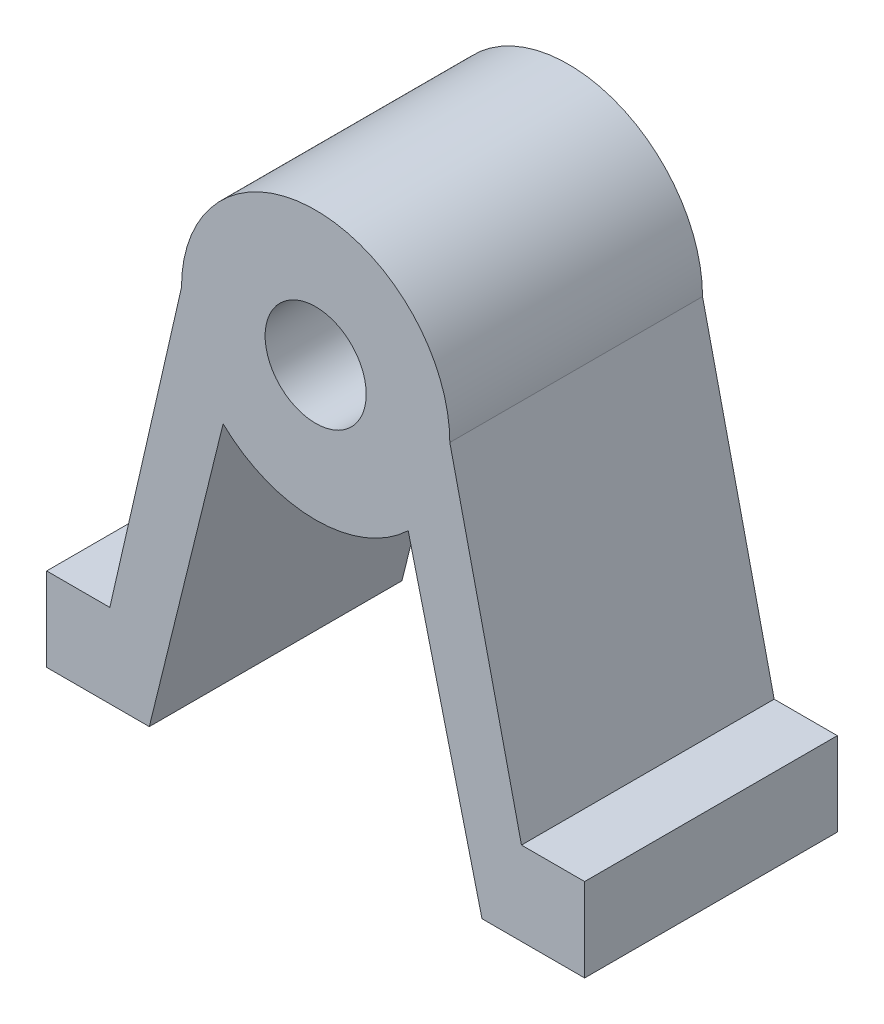
ISO-10303-21;
HEADER;
FILE_DESCRIPTION(('STEP AP214'),'2;1');
FILE_NAME('part.step','',(''),(''),'','','');
FILE_SCHEMA(('AUTOMOTIVE_DESIGN { 1 0 10303 214 1 1 1 1 }'));
ENDSEC;
DATA;
#1=APPLICATION_CONTEXT('core data for automotive mechanical design processes');
#2=APPLICATION_PROTOCOL_DEFINITION('international standard','automotive_design',2000,#1);
#3=PRODUCT_CONTEXT('',#1,'mechanical');
#4=PRODUCT('Part','Part','',(#3));
#5=PRODUCT_RELATED_PRODUCT_CATEGORY('part','',(#4));
#6=PRODUCT_DEFINITION_FORMATION('','',#4);
#7=PRODUCT_DEFINITION_CONTEXT('part definition',#1,'design');
#8=PRODUCT_DEFINITION('design','',#6,#7);
#9=PRODUCT_DEFINITION_SHAPE('','',#8);
#10=(LENGTH_UNIT() NAMED_UNIT(*) SI_UNIT(.MILLI.,.METRE.));
#11=(NAMED_UNIT(*) PLANE_ANGLE_UNIT() SI_UNIT($,.RADIAN.));
#12=(NAMED_UNIT(*) SI_UNIT($,.STERADIAN.) SOLID_ANGLE_UNIT());
#13=UNCERTAINTY_MEASURE_WITH_UNIT(LENGTH_MEASURE(1.E-05),#10,'distance_accuracy_value','');
#14=(GEOMETRIC_REPRESENTATION_CONTEXT(3) GLOBAL_UNCERTAINTY_ASSIGNED_CONTEXT((#13)) GLOBAL_UNIT_ASSIGNED_CONTEXT((#10,
#11,#12)) REPRESENTATION_CONTEXT('',''));
#15=CARTESIAN_POINT('',(0.,0.,0.));
#16=DIRECTION('',(0.,0.,1.));
#17=DIRECTION('',(1.,0.,0.));
#18=AXIS2_PLACEMENT_3D('',#15,#16,#17);
#19=CARTESIAN_POINT('',(-48.3392895586652,36.6997165410836,20.));
#20=DIRECTION('',(0.,0.,1.));
#21=DIRECTION('',(1.,0.,0.));
#22=AXIS2_PLACEMENT_3D('',#19,#20,#21);
#23=PLANE('',#22);
#24=CARTESIAN_POINT('',(-48.3392895586652,36.6997165410836,20.));
#25=DIRECTION('',(0.,0.,1.));
#26=DIRECTION('',(1.,0.,0.));
#27=AXIS2_PLACEMENT_3D('',#24,#25,#26);
#28=CIRCLE('',#27,10.62);
#29=CARTESIAN_POINT('',(-37.7192895586652,36.6997165410836,20.));
#30=VERTEX_POINT('',#29);
#31=CARTESIAN_POINT('',(-58.9592895586652,36.6997165410836,20.));
#32=VERTEX_POINT('',#31);
#33=EDGE_CURVE('E179',#30,#32,#28,.T.);
#34=ORIENTED_EDGE('',*,*,#33,.T.);
#35=DIRECTION('',(-0.223216238641194,-0.974768952525098,0.));
#36=VECTOR('',#35,1.);
#37=CARTESIAN_POINT('',(-58.9592895586652,36.6997165410836,20.));
#38=LINE('',#37,#36);
#39=CARTESIAN_POINT('',(-64.6288762631638,11.9410469799597,20.));
#40=VERTEX_POINT('',#39);
#41=EDGE_CURVE('E107',#32,#40,#38,.T.);
#42=ORIENTED_EDGE('',*,*,#41,.T.);
#43=DIRECTION('',(-1.,0.,0.));
#44=VECTOR('',#43,1.);
#45=CARTESIAN_POINT('',(-64.6288762631638,11.9410469799597,20.));
#46=LINE('',#45,#44);
#47=CARTESIAN_POINT('',(-69.6288762631638,11.9410469799597,20.));
#48=VERTEX_POINT('',#47);
#49=EDGE_CURVE('E206',#40,#48,#46,.T.);
#50=ORIENTED_EDGE('',*,*,#49,.T.);
#51=DIRECTION('',(0.,-1.,0.));
#52=VECTOR('',#51,1.);
#53=CARTESIAN_POINT('',(-69.6288762631638,11.9410469799597,20.));
#54=LINE('',#53,#52);
#55=CARTESIAN_POINT('',(-69.6288762631638,5.3297165410836,20.));
#56=VERTEX_POINT('',#55);
#57=EDGE_CURVE('E225',#48,#56,#54,.T.);
#58=ORIENTED_EDGE('',*,*,#57,.T.);
#59=DIRECTION('',(1.,0.,0.));
#60=VECTOR('',#59,1.);
#61=CARTESIAN_POINT('',(-69.6288762631638,5.3297165410836,20.));
#62=LINE('',#61,#60);
#63=CARTESIAN_POINT('',(-61.5049473980364,5.32971654108361,20.));
#64=VERTEX_POINT('',#63);
#65=EDGE_CURVE('E222',#56,#64,#62,.T.);
#66=ORIENTED_EDGE('',*,*,#65,.T.);
#67=DIRECTION('',(0.239510428212792,0.970893791708097,0.));
#68=VECTOR('',#67,1.);
#69=CARTESIAN_POINT('',(-55.6634033552751,29.0093487284034,20.));
#70=LINE('',#69,#68);
#71=CARTESIAN_POINT('',(-55.6634033552751,29.0093487284034,20.));
#72=VERTEX_POINT('',#71);
#73=EDGE_CURVE('E224',#64,#72,#70,.T.);
#74=ORIENTED_EDGE('',*,*,#73,.T.);
#75=CARTESIAN_POINT('',(-48.3392895586652,36.6997165410836,20.));
#76=DIRECTION('',(0.,0.,1.));
#77=DIRECTION('',(1.,0.,0.));
#78=AXIS2_PLACEMENT_3D('',#75,#76,#77);
#79=CIRCLE('',#78,10.62);
#80=CARTESIAN_POINT('',(-41.0151757620553,29.0093487284034,20.));
#81=VERTEX_POINT('',#80);
#82=EDGE_CURVE('E227',#72,#81,#79,.T.);
#83=ORIENTED_EDGE('',*,*,#82,.T.);
#84=DIRECTION('',(0.239510428212792,-0.970893791708097,0.));
#85=VECTOR('',#84,1.);
#86=CARTESIAN_POINT('',(-41.0151757620553,29.0093487284034,20.));
#87=LINE('',#86,#85);
#88=CARTESIAN_POINT('',(-35.173631719294,5.32971654108361,20.));
#89=VERTEX_POINT('',#88);
#90=EDGE_CURVE('E233',#81,#89,#87,.T.);
#91=ORIENTED_EDGE('',*,*,#90,.T.);
#92=DIRECTION('',(1.,0.,0.));
#93=VECTOR('',#92,1.);
#94=CARTESIAN_POINT('',(-27.0497028541666,5.3297165410836,20.));
#95=LINE('',#94,#93);
#96=CARTESIAN_POINT('',(-27.0497028541666,5.3297165410836,20.));
#97=VERTEX_POINT('',#96);
#98=EDGE_CURVE('E138',#89,#97,#95,.T.);
#99=ORIENTED_EDGE('',*,*,#98,.T.);
#100=DIRECTION('',(0.,1.,0.));
#101=VECTOR('',#100,1.);
#102=CARTESIAN_POINT('',(-27.0497028541666,11.9410469799597,20.));
#103=LINE('',#102,#101);
#104=CARTESIAN_POINT('',(-27.0497028541666,11.9410469799597,20.));
#105=VERTEX_POINT('',#104);
#106=EDGE_CURVE('E132',#97,#105,#103,.T.);
#107=ORIENTED_EDGE('',*,*,#106,.T.);
#108=DIRECTION('',(-1.,0.,0.));
#109=VECTOR('',#108,1.);
#110=CARTESIAN_POINT('',(-32.0497028541666,11.9410469799597,20.));
#111=LINE('',#110,#109);
#112=CARTESIAN_POINT('',(-32.0497028541666,11.9410469799597,20.));
#113=VERTEX_POINT('',#112);
#114=EDGE_CURVE('E136',#105,#113,#111,.T.);
#115=ORIENTED_EDGE('',*,*,#114,.T.);
#116=DIRECTION('',(-0.223216238641194,0.974768952525098,0.));
#117=VECTOR('',#116,1.);
#118=CARTESIAN_POINT('',(-37.7192895586652,36.6997165410836,20.));
#119=LINE('',#118,#117);
#120=EDGE_CURVE('E52',#113,#30,#119,.T.);
#121=ORIENTED_EDGE('',*,*,#120,.T.);
#122=EDGE_LOOP('',(#34,#42,#50,#58,#66,#74,#83,#91,#99,#107,#115,#121));
#123=FACE_BOUND('',#122,.T.);
#124=CARTESIAN_POINT('',(-48.3392895586652,36.6997165410836,20.));
#125=DIRECTION('',(0.,0.,1.));
#126=DIRECTION('',(1.,0.,0.));
#127=AXIS2_PLACEMENT_3D('',#124,#125,#126);
#128=CIRCLE('',#127,4.);
#129=CARTESIAN_POINT('',(-44.3392895586652,36.6997165410836,20.));
#130=VERTEX_POINT('',#129);
#131=EDGE_CURVE('E160',#130,#130,#128,.T.);
#132=ORIENTED_EDGE('',*,*,#131,.F.);
#133=EDGE_LOOP('',(#132));
#134=FACE_BOUND('',#133,.T.);
#135=ADVANCED_FACE('F35',(#123,#134),#23,.T.);
#136=CARTESIAN_POINT('',(-48.3392895586652,36.6997165410836,0.));
#137=DIRECTION('',(0.,0.,1.));
#138=DIRECTION('',(1.,0.,0.));
#139=AXIS2_PLACEMENT_3D('',#136,#137,#138);
#140=PLANE('',#139);
#141=CARTESIAN_POINT('',(-48.3392895586652,36.6997165410836,0.));
#142=DIRECTION('',(0.,0.,1.));
#143=DIRECTION('',(1.,0.,0.));
#144=AXIS2_PLACEMENT_3D('',#141,#142,#143);
#145=CIRCLE('',#144,10.62);
#146=CARTESIAN_POINT('',(-37.7192895586652,36.6997165410836,0.));
#147=VERTEX_POINT('',#146);
#148=CARTESIAN_POINT('',(-58.9592895586652,36.6997165410836,0.));
#149=VERTEX_POINT('',#148);
#150=EDGE_CURVE('E156',#147,#149,#145,.T.);
#151=ORIENTED_EDGE('',*,*,#150,.F.);
#152=DIRECTION('',(-0.223216238641194,0.974768952525098,0.));
#153=VECTOR('',#152,1.);
#154=CARTESIAN_POINT('',(-37.7192895586652,36.6997165410836,0.));
#155=LINE('',#154,#153);
#156=CARTESIAN_POINT('',(-32.0497028541666,11.9410469799597,0.));
#157=VERTEX_POINT('',#156);
#158=EDGE_CURVE('E99',#157,#147,#155,.T.);
#159=ORIENTED_EDGE('',*,*,#158,.F.);
#160=DIRECTION('',(-1.,0.,0.));
#161=VECTOR('',#160,1.);
#162=CARTESIAN_POINT('',(-32.0497028541666,11.9410469799597,0.));
#163=LINE('',#162,#161);
#164=CARTESIAN_POINT('',(-27.0497028541666,11.9410469799597,0.));
#165=VERTEX_POINT('',#164);
#166=EDGE_CURVE('E93',#165,#157,#163,.T.);
#167=ORIENTED_EDGE('',*,*,#166,.F.);
#168=DIRECTION('',(0.,1.,0.));
#169=VECTOR('',#168,1.);
#170=CARTESIAN_POINT('',(-27.0497028541666,11.9410469799597,0.));
#171=LINE('',#170,#169);
#172=CARTESIAN_POINT('',(-27.0497028541666,5.3297165410836,0.));
#173=VERTEX_POINT('',#172);
#174=EDGE_CURVE('E146',#173,#165,#171,.T.);
#175=ORIENTED_EDGE('',*,*,#174,.F.);
#176=DIRECTION('',(1.,0.,0.));
#177=VECTOR('',#176,1.);
#178=CARTESIAN_POINT('',(-27.0497028541666,5.3297165410836,0.));
#179=LINE('',#178,#177);
#180=CARTESIAN_POINT('',(-35.173631719294,5.32971654108361,0.));
#181=VERTEX_POINT('',#180);
#182=EDGE_CURVE('E174',#181,#173,#179,.T.);
#183=ORIENTED_EDGE('',*,*,#182,.F.);
#184=DIRECTION('',(0.239510428212792,-0.970893791708097,0.));
#185=VECTOR('',#184,1.);
#186=CARTESIAN_POINT('',(-41.0151757620553,29.0093487284034,0.));
#187=LINE('',#186,#185);
#188=CARTESIAN_POINT('',(-41.0151757620553,29.0093487284034,0.));
#189=VERTEX_POINT('',#188);
#190=EDGE_CURVE('E172',#189,#181,#187,.T.);
#191=ORIENTED_EDGE('',*,*,#190,.F.);
#192=CARTESIAN_POINT('',(-48.3392895586652,36.6997165410836,0.));
#193=DIRECTION('',(0.,0.,1.));
#194=DIRECTION('',(1.,0.,0.));
#195=AXIS2_PLACEMENT_3D('',#192,#193,#194);
#196=CIRCLE('',#195,10.62);
#197=CARTESIAN_POINT('',(-55.6634033552751,29.0093487284034,0.));
#198=VERTEX_POINT('',#197);
#199=EDGE_CURVE('E170',#198,#189,#196,.T.);
#200=ORIENTED_EDGE('',*,*,#199,.F.);
#201=DIRECTION('',(0.239510428212792,0.970893791708097,0.));
#202=VECTOR('',#201,1.);
#203=CARTESIAN_POINT('',(-55.6634033552751,29.0093487284034,0.));
#204=LINE('',#203,#202);
#205=CARTESIAN_POINT('',(-61.5049473980364,5.32971654108361,0.));
#206=VERTEX_POINT('',#205);
#207=EDGE_CURVE('E168',#206,#198,#204,.T.);
#208=ORIENTED_EDGE('',*,*,#207,.F.);
#209=DIRECTION('',(1.,0.,0.));
#210=VECTOR('',#209,1.);
#211=CARTESIAN_POINT('',(-69.6288762631638,5.3297165410836,0.));
#212=LINE('',#211,#210);
#213=CARTESIAN_POINT('',(-69.6288762631638,5.3297165410836,0.));
#214=VERTEX_POINT('',#213);
#215=EDGE_CURVE('E166',#214,#206,#212,.T.);
#216=ORIENTED_EDGE('',*,*,#215,.F.);
#217=DIRECTION('',(0.,-1.,0.));
#218=VECTOR('',#217,1.);
#219=CARTESIAN_POINT('',(-69.6288762631638,11.9410469799597,0.));
#220=LINE('',#219,#218);
#221=CARTESIAN_POINT('',(-69.6288762631638,11.9410469799597,0.));
#222=VERTEX_POINT('',#221);
#223=EDGE_CURVE('E164',#222,#214,#220,.T.);
#224=ORIENTED_EDGE('',*,*,#223,.F.);
#225=DIRECTION('',(-1.,0.,0.));
#226=VECTOR('',#225,1.);
#227=CARTESIAN_POINT('',(-64.6288762631638,11.9410469799597,0.));
#228=LINE('',#227,#226);
#229=CARTESIAN_POINT('',(-64.6288762631638,11.9410469799597,0.));
#230=VERTEX_POINT('',#229);
#231=EDGE_CURVE('E162',#230,#222,#228,.T.);
#232=ORIENTED_EDGE('',*,*,#231,.F.);
#233=DIRECTION('',(-0.223216238641194,-0.974768952525098,0.));
#234=VECTOR('',#233,1.);
#235=CARTESIAN_POINT('',(-58.9592895586652,36.6997165410836,0.));
#236=LINE('',#235,#234);
#237=EDGE_CURVE('E159',#149,#230,#236,.T.);
#238=ORIENTED_EDGE('',*,*,#237,.F.);
#239=EDGE_LOOP('',(#151,#159,#167,#175,#183,#191,#200,#208,#216,#224,#232,#238));
#240=FACE_BOUND('',#239,.T.);
#241=CARTESIAN_POINT('',(-48.3392895586652,36.6997165410836,0.));
#242=DIRECTION('',(0.,0.,1.));
#243=DIRECTION('',(1.,0.,0.));
#244=AXIS2_PLACEMENT_3D('',#241,#242,#243);
#245=CIRCLE('',#244,4.);
#246=CARTESIAN_POINT('',(-44.3392895586652,36.6997165410836,0.));
#247=VERTEX_POINT('',#246);
#248=EDGE_CURVE('E380',#247,#247,#245,.T.);
#249=ORIENTED_EDGE('',*,*,#248,.T.);
#250=EDGE_LOOP('',(#249));
#251=FACE_BOUND('',#250,.T.);
#252=ADVANCED_FACE('F210',(#240,#251),#140,.F.);
#253=CARTESIAN_POINT('',(-48.3392895586652,36.6997165410836,20.));
#254=DIRECTION('',(0.,0.,-1.));
#255=DIRECTION('',(-1.,0.,0.));
#256=AXIS2_PLACEMENT_3D('',#253,#254,#255);
#257=CYLINDRICAL_SURFACE('',#256,10.62);
#258=ORIENTED_EDGE('',*,*,#150,.T.);
#259=DIRECTION('',(0.,0.,-1.));
#260=VECTOR('',#259,1.);
#261=CARTESIAN_POINT('',(-58.9592895586652,36.6997165410836,20.));
#262=LINE('',#261,#260);
#263=EDGE_CURVE('E11',#32,#149,#262,.T.);
#264=ORIENTED_EDGE('',*,*,#263,.F.);
#265=ORIENTED_EDGE('',*,*,#33,.F.);
#266=DIRECTION('',(0.,0.,-1.));
#267=VECTOR('',#266,1.);
#268=CARTESIAN_POINT('',(-37.7192895586652,36.6997165410836,20.));
#269=LINE('',#268,#267);
#270=EDGE_CURVE('E152',#30,#147,#269,.T.);
#271=ORIENTED_EDGE('',*,*,#270,.T.);
#272=EDGE_LOOP('',(#258,#264,#265,#271));
#273=FACE_BOUND('',#272,.T.);
#274=ADVANCED_FACE('F37',(#273),#257,.T.);
#275=CARTESIAN_POINT('',(-58.9592895586652,36.6997165410836,20.));
#276=DIRECTION('',(0.974768952525098,-0.223216238641194,0.));
#277=DIRECTION('',(0.223216238641194,0.974768952525099,0.));
#278=AXIS2_PLACEMENT_3D('',#275,#276,#277);
#279=PLANE('',#278);
#280=ORIENTED_EDGE('',*,*,#237,.T.);
#281=DIRECTION('',(0.,0.,-1.));
#282=VECTOR('',#281,1.);
#283=CARTESIAN_POINT('',(-64.6288762631638,11.9410469799597,20.));
#284=LINE('',#283,#282);
#285=EDGE_CURVE('E44',#40,#230,#284,.T.);
#286=ORIENTED_EDGE('',*,*,#285,.F.);
#287=ORIENTED_EDGE('',*,*,#41,.F.);
#288=ORIENTED_EDGE('',*,*,#263,.T.);
#289=EDGE_LOOP('',(#280,#286,#287,#288));
#290=FACE_BOUND('',#289,.T.);
#291=ADVANCED_FACE('F267',(#290),#279,.F.);
#292=CARTESIAN_POINT('',(-64.6288762631638,11.9410469799597,20.));
#293=DIRECTION('',(0.,-1.,0.));
#294=DIRECTION('',(0.,0.,-1.));
#295=AXIS2_PLACEMENT_3D('',#292,#293,#294);
#296=PLANE('',#295);
#297=ORIENTED_EDGE('',*,*,#231,.T.);
#298=DIRECTION('',(0.,0.,-1.));
#299=VECTOR('',#298,1.);
#300=CARTESIAN_POINT('',(-69.6288762631638,11.9410469799597,20.));
#301=LINE('',#300,#299);
#302=EDGE_CURVE('E198',#48,#222,#301,.T.);
#303=ORIENTED_EDGE('',*,*,#302,.F.);
#304=ORIENTED_EDGE('',*,*,#49,.F.);
#305=ORIENTED_EDGE('',*,*,#285,.T.);
#306=EDGE_LOOP('',(#297,#303,#304,#305));
#307=FACE_BOUND('',#306,.T.);
#308=ADVANCED_FACE('F204',(#307),#296,.F.);
#309=CARTESIAN_POINT('',(-69.6288762631638,11.9410469799597,20.));
#310=DIRECTION('',(1.,0.,0.));
#311=DIRECTION('',(0.,0.,-1.));
#312=AXIS2_PLACEMENT_3D('',#309,#310,#311);
#313=PLANE('',#312);
#314=ORIENTED_EDGE('',*,*,#223,.T.);
#315=DIRECTION('',(0.,0.,-1.));
#316=VECTOR('',#315,1.);
#317=CARTESIAN_POINT('',(-69.6288762631638,5.3297165410836,20.));
#318=LINE('',#317,#316);
#319=EDGE_CURVE('E195',#56,#214,#318,.T.);
#320=ORIENTED_EDGE('',*,*,#319,.F.);
#321=ORIENTED_EDGE('',*,*,#57,.F.);
#322=ORIENTED_EDGE('',*,*,#302,.T.);
#323=EDGE_LOOP('',(#314,#320,#321,#322));
#324=FACE_BOUND('',#323,.T.);
#325=ADVANCED_FACE('F216',(#324),#313,.F.);
#326=CARTESIAN_POINT('',(-69.6288762631638,5.3297165410836,20.));
#327=DIRECTION('',(0.,1.,0.));
#328=DIRECTION('',(-1.,0.,0.));
#329=AXIS2_PLACEMENT_3D('',#326,#327,#328);
#330=PLANE('',#329);
#331=ORIENTED_EDGE('',*,*,#215,.T.);
#332=DIRECTION('',(0.,0.,-1.));
#333=VECTOR('',#332,1.);
#334=CARTESIAN_POINT('',(-61.5049473980364,5.32971654108361,20.));
#335=LINE('',#334,#333);
#336=EDGE_CURVE('E192',#64,#206,#335,.T.);
#337=ORIENTED_EDGE('',*,*,#336,.F.);
#338=ORIENTED_EDGE('',*,*,#65,.F.);
#339=ORIENTED_EDGE('',*,*,#319,.T.);
#340=EDGE_LOOP('',(#331,#337,#338,#339));
#341=FACE_BOUND('',#340,.T.);
#342=ADVANCED_FACE('F220',(#341),#330,.F.);
#343=CARTESIAN_POINT('',(-55.6634033552751,29.0093487284034,20.));
#344=DIRECTION('',(-0.970893791708097,0.239510428212792,0.));
#345=DIRECTION('',(-0.239510428212792,-0.970893791708097,0.));
#346=AXIS2_PLACEMENT_3D('',#343,#344,#345);
#347=PLANE('',#346);
#348=ORIENTED_EDGE('',*,*,#207,.T.);
#349=DIRECTION('',(0.,0.,-1.));
#350=VECTOR('',#349,1.);
#351=CARTESIAN_POINT('',(-55.6634033552751,29.0093487284034,20.));
#352=LINE('',#351,#350);
#353=EDGE_CURVE('E189',#72,#198,#352,.T.);
#354=ORIENTED_EDGE('',*,*,#353,.F.);
#355=ORIENTED_EDGE('',*,*,#73,.F.);
#356=ORIENTED_EDGE('',*,*,#336,.T.);
#357=EDGE_LOOP('',(#348,#354,#355,#356));
#358=FACE_BOUND('',#357,.T.);
#359=ADVANCED_FACE('F280',(#358),#347,.F.);
#360=CARTESIAN_POINT('',(-48.3392895586652,36.6997165410836,20.));
#361=DIRECTION('',(0.,0.,-1.));
#362=DIRECTION('',(-1.,0.,0.));
#363=AXIS2_PLACEMENT_3D('',#360,#361,#362);
#364=CYLINDRICAL_SURFACE('',#363,10.62);
#365=ORIENTED_EDGE('',*,*,#199,.T.);
#366=DIRECTION('',(0.,0.,-1.));
#367=VECTOR('',#366,1.);
#368=CARTESIAN_POINT('',(-41.0151757620553,29.0093487284034,20.));
#369=LINE('',#368,#367);
#370=EDGE_CURVE('E186',#81,#189,#369,.T.);
#371=ORIENTED_EDGE('',*,*,#370,.F.);
#372=ORIENTED_EDGE('',*,*,#82,.F.);
#373=ORIENTED_EDGE('',*,*,#353,.T.);
#374=EDGE_LOOP('',(#365,#371,#372,#373));
#375=FACE_BOUND('',#374,.T.);
#376=ADVANCED_FACE('F283',(#375),#364,.T.);
#377=CARTESIAN_POINT('',(-41.0151757620553,29.0093487284034,20.));
#378=DIRECTION('',(0.970893791708097,0.239510428212792,0.));
#379=DIRECTION('',(-0.239510428212792,0.970893791708097,0.));
#380=AXIS2_PLACEMENT_3D('',#377,#378,#379);
#381=PLANE('',#380);
#382=ORIENTED_EDGE('',*,*,#190,.T.);
#383=DIRECTION('',(0.,0.,-1.));
#384=VECTOR('',#383,1.);
#385=CARTESIAN_POINT('',(-35.173631719294,5.32971654108361,20.));
#386=LINE('',#385,#384);
#387=EDGE_CURVE('E183',#89,#181,#386,.T.);
#388=ORIENTED_EDGE('',*,*,#387,.F.);
#389=ORIENTED_EDGE('',*,*,#90,.F.);
#390=ORIENTED_EDGE('',*,*,#370,.T.);
#391=EDGE_LOOP('',(#382,#388,#389,#390));
#392=FACE_BOUND('',#391,.T.);
#393=ADVANCED_FACE('F239',(#392),#381,.F.);
#394=CARTESIAN_POINT('',(-27.0497028541666,5.3297165410836,20.));
#395=DIRECTION('',(0.,1.,0.));
#396=DIRECTION('',(-1.,0.,0.));
#397=AXIS2_PLACEMENT_3D('',#394,#395,#396);
#398=PLANE('',#397);
#399=ORIENTED_EDGE('',*,*,#182,.T.);
#400=DIRECTION('',(0.,0.,-1.));
#401=VECTOR('',#400,1.);
#402=CARTESIAN_POINT('',(-27.0497028541666,5.3297165410836,20.));
#403=LINE('',#402,#401);
#404=EDGE_CURVE('E147',#97,#173,#403,.T.);
#405=ORIENTED_EDGE('',*,*,#404,.F.);
#406=ORIENTED_EDGE('',*,*,#98,.F.);
#407=ORIENTED_EDGE('',*,*,#387,.T.);
#408=EDGE_LOOP('',(#399,#405,#406,#407));
#409=FACE_BOUND('',#408,.T.);
#410=ADVANCED_FACE('F243',(#409),#398,.F.);
#411=CARTESIAN_POINT('',(-27.0497028541666,11.9410469799597,20.));
#412=DIRECTION('',(-1.,0.,0.));
#413=DIRECTION('',(0.,0.,1.));
#414=AXIS2_PLACEMENT_3D('',#411,#412,#413);
#415=PLANE('',#414);
#416=ORIENTED_EDGE('',*,*,#174,.T.);
#417=DIRECTION('',(0.,0.,-1.));
#418=VECTOR('',#417,1.);
#419=CARTESIAN_POINT('',(-27.0497028541666,11.9410469799597,20.));
#420=LINE('',#419,#418);
#421=EDGE_CURVE('E143',#105,#165,#420,.T.);
#422=ORIENTED_EDGE('',*,*,#421,.F.);
#423=ORIENTED_EDGE('',*,*,#106,.F.);
#424=ORIENTED_EDGE('',*,*,#404,.T.);
#425=EDGE_LOOP('',(#416,#422,#423,#424));
#426=FACE_BOUND('',#425,.T.);
#427=ADVANCED_FACE('F144',(#426),#415,.F.);
#428=CARTESIAN_POINT('',(-32.0497028541666,11.9410469799597,20.));
#429=DIRECTION('',(0.,-1.,0.));
#430=DIRECTION('',(0.,0.,-1.));
#431=AXIS2_PLACEMENT_3D('',#428,#429,#430);
#432=PLANE('',#431);
#433=ORIENTED_EDGE('',*,*,#166,.T.);
#434=DIRECTION('',(0.,0.,-1.));
#435=VECTOR('',#434,1.);
#436=CARTESIAN_POINT('',(-32.0497028541666,11.9410469799597,20.));
#437=LINE('',#436,#435);
#438=EDGE_CURVE('E148',#113,#157,#437,.T.);
#439=ORIENTED_EDGE('',*,*,#438,.F.);
#440=ORIENTED_EDGE('',*,*,#114,.F.);
#441=ORIENTED_EDGE('',*,*,#421,.T.);
#442=EDGE_LOOP('',(#433,#439,#440,#441));
#443=FACE_BOUND('',#442,.T.);
#444=ADVANCED_FACE('F150',(#443),#432,.F.);
#445=CARTESIAN_POINT('',(-37.7192895586652,36.6997165410836,20.));
#446=DIRECTION('',(-0.974768952525098,-0.223216238641194,0.));
#447=DIRECTION('',(0.223216238641194,-0.974768952525099,0.));
#448=AXIS2_PLACEMENT_3D('',#445,#446,#447);
#449=PLANE('',#448);
#450=ORIENTED_EDGE('',*,*,#158,.T.);
#451=ORIENTED_EDGE('',*,*,#270,.F.);
#452=ORIENTED_EDGE('',*,*,#120,.F.);
#453=ORIENTED_EDGE('',*,*,#438,.T.);
#454=EDGE_LOOP('',(#450,#451,#452,#453));
#455=FACE_BOUND('',#454,.T.);
#456=ADVANCED_FACE('F247',(#455),#449,.F.);
#457=CARTESIAN_POINT('',(-48.3392895586652,36.6997165410836,20.));
#458=DIRECTION('',(0.,0.,-1.));
#459=DIRECTION('',(-1.,0.,0.));
#460=AXIS2_PLACEMENT_3D('',#457,#458,#459);
#461=CYLINDRICAL_SURFACE('',#460,4.);
#462=ORIENTED_EDGE('',*,*,#131,.T.);
#463=EDGE_LOOP('',(#462));
#464=FACE_BOUND('',#463,.T.);
#465=ORIENTED_EDGE('',*,*,#248,.F.);
#466=EDGE_LOOP('',(#465));
#467=FACE_BOUND('',#466,.T.);
#468=ADVANCED_FACE('F249',(#464,#467),#461,.F.);
#469=CLOSED_SHELL('',(#135,#252,#274,#291,#308,#325,#342,#359,#376,#393,#410,#427,#444,#456,#468));
#470=MANIFOLD_SOLID_BREP('B2',#469);
#471=ADVANCED_BREP_SHAPE_REPRESENTATION('',(#18,#470),#14);
#472=SHAPE_DEFINITION_REPRESENTATION(#9,#471);
ENDSEC;
END-ISO-10303-21;
